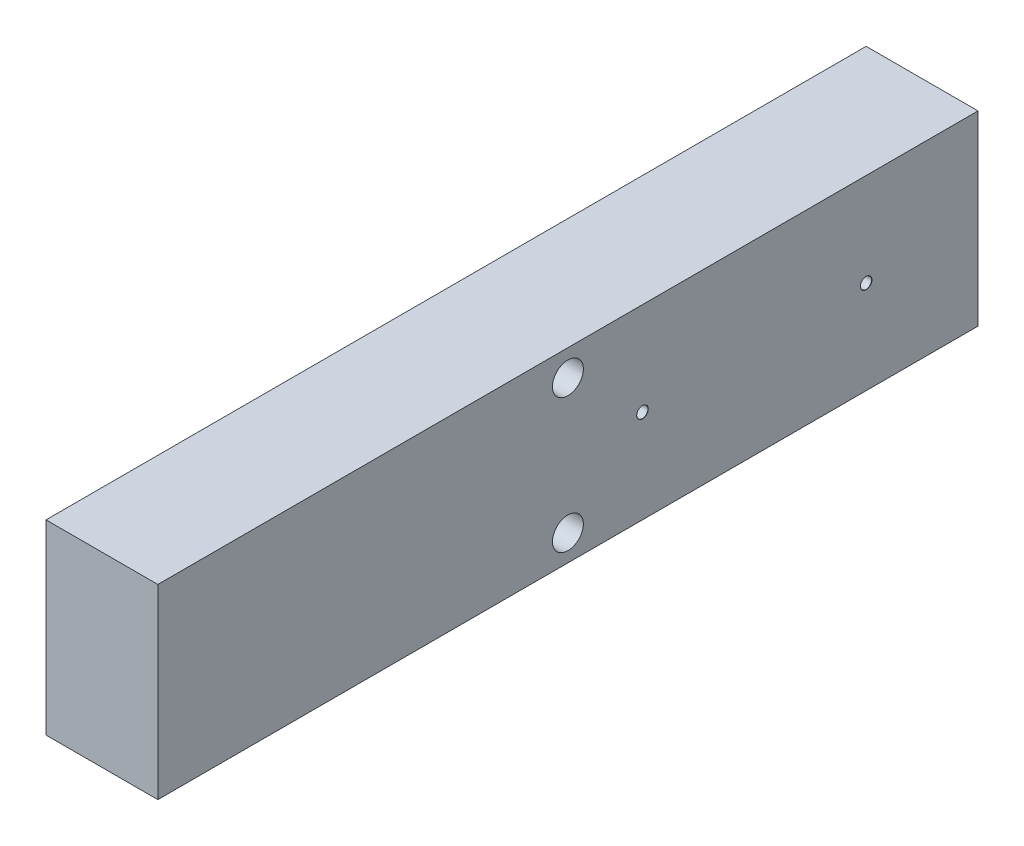
ISO-10303-21;
HEADER;
FILE_DESCRIPTION(('STEP AP214'),'2;1');
FILE_NAME('part.step','',(''),(''),'','','');
FILE_SCHEMA(('AUTOMOTIVE_DESIGN { 1 0 10303 214 1 1 1 1 }'));
ENDSEC;
DATA;
#1=APPLICATION_CONTEXT('core data for automotive mechanical design processes');
#2=APPLICATION_PROTOCOL_DEFINITION('international standard','automotive_design',2000,#1);
#3=PRODUCT_CONTEXT('',#1,'mechanical');
#4=PRODUCT('Part','Part','',(#3));
#5=PRODUCT_RELATED_PRODUCT_CATEGORY('part','',(#4));
#6=PRODUCT_DEFINITION_FORMATION('','',#4);
#7=PRODUCT_DEFINITION_CONTEXT('part definition',#1,'design');
#8=PRODUCT_DEFINITION('design','',#6,#7);
#9=PRODUCT_DEFINITION_SHAPE('','',#8);
#10=(LENGTH_UNIT() NAMED_UNIT(*) SI_UNIT(.MILLI.,.METRE.));
#11=(NAMED_UNIT(*) PLANE_ANGLE_UNIT() SI_UNIT($,.RADIAN.));
#12=(NAMED_UNIT(*) SI_UNIT($,.STERADIAN.) SOLID_ANGLE_UNIT());
#13=UNCERTAINTY_MEASURE_WITH_UNIT(LENGTH_MEASURE(1.E-05),#10,'distance_accuracy_value','');
#14=(GEOMETRIC_REPRESENTATION_CONTEXT(3) GLOBAL_UNCERTAINTY_ASSIGNED_CONTEXT((#13)) GLOBAL_UNIT_ASSIGNED_CONTEXT((#10,
#11,#12)) REPRESENTATION_CONTEXT('',''));
#15=CARTESIAN_POINT('',(0.,0.,0.));
#16=DIRECTION('',(0.,0.,1.));
#17=DIRECTION('',(1.,0.,0.));
#18=AXIS2_PLACEMENT_3D('',#15,#16,#17);
#19=CARTESIAN_POINT('',(15.,12.5,105.));
#20=DIRECTION('',(0.,0.,-1.));
#21=DIRECTION('',(-1.,0.,0.));
#22=AXIS2_PLACEMENT_3D('',#19,#20,#21);
#23=PLANE('',#22);
#24=DIRECTION('',(0.,-1.,0.));
#25=VECTOR('',#24,1.);
#26=CARTESIAN_POINT('',(0.,12.5,105.));
#27=LINE('',#26,#25);
#28=CARTESIAN_POINT('',(0.,12.5,105.));
#29=VERTEX_POINT('',#28);
#30=CARTESIAN_POINT('',(0.,-12.5,105.));
#31=VERTEX_POINT('',#30);
#32=EDGE_CURVE('E254',#29,#31,#27,.T.);
#33=ORIENTED_EDGE('',*,*,#32,.T.);
#34=DIRECTION('',(-1.,0.,0.));
#35=VECTOR('',#34,1.);
#36=CARTESIAN_POINT('',(15.,-12.5,105.));
#37=LINE('',#36,#35);
#38=CARTESIAN_POINT('',(15.,-12.5,105.));
#39=VERTEX_POINT('',#38);
#40=EDGE_CURVE('E139',#39,#31,#37,.T.);
#41=ORIENTED_EDGE('',*,*,#40,.F.);
#42=DIRECTION('',(0.,-1.,0.));
#43=VECTOR('',#42,1.);
#44=CARTESIAN_POINT('',(15.,12.5,105.));
#45=LINE('',#44,#43);
#46=CARTESIAN_POINT('',(15.,12.5,105.));
#47=VERTEX_POINT('',#46);
#48=EDGE_CURVE('E273',#47,#39,#45,.T.);
#49=ORIENTED_EDGE('',*,*,#48,.F.);
#50=DIRECTION('',(-1.,0.,0.));
#51=VECTOR('',#50,1.);
#52=CARTESIAN_POINT('',(15.,12.5,105.));
#53=LINE('',#52,#51);
#54=EDGE_CURVE('E60',#47,#29,#53,.T.);
#55=ORIENTED_EDGE('',*,*,#54,.T.);
#56=EDGE_LOOP('',(#33,#41,#49,#55));
#57=FACE_BOUND('',#56,.T.);
#58=ADVANCED_FACE('F36',(#57),#23,.F.);
#59=CARTESIAN_POINT('',(15.,-12.5,105.));
#60=DIRECTION('',(0.,1.,0.));
#61=DIRECTION('',(1.,0.,0.));
#62=AXIS2_PLACEMENT_3D('',#59,#60,#61);
#63=PLANE('',#62);
#64=DIRECTION('',(0.,0.,-1.));
#65=VECTOR('',#64,1.);
#66=CARTESIAN_POINT('',(0.,-12.5,105.));
#67=LINE('',#66,#65);
#68=CARTESIAN_POINT('',(0.,-12.5,-5.));
#69=VERTEX_POINT('',#68);
#70=EDGE_CURVE('E256',#31,#69,#67,.T.);
#71=ORIENTED_EDGE('',*,*,#70,.T.);
#72=DIRECTION('',(-1.,0.,0.));
#73=VECTOR('',#72,1.);
#74=CARTESIAN_POINT('',(15.,-12.5,-5.));
#75=LINE('',#74,#73);
#76=CARTESIAN_POINT('',(15.,-12.5,-5.));
#77=VERTEX_POINT('',#76);
#78=EDGE_CURVE('E277',#77,#69,#75,.T.);
#79=ORIENTED_EDGE('',*,*,#78,.F.);
#80=DIRECTION('',(0.,0.,-1.));
#81=VECTOR('',#80,1.);
#82=CARTESIAN_POINT('',(15.,-12.5,105.));
#83=LINE('',#82,#81);
#84=EDGE_CURVE('E87',#39,#77,#83,.T.);
#85=ORIENTED_EDGE('',*,*,#84,.F.);
#86=ORIENTED_EDGE('',*,*,#40,.T.);
#87=EDGE_LOOP('',(#71,#79,#85,#86));
#88=FACE_BOUND('',#87,.T.);
#89=ADVANCED_FACE('F248',(#88),#63,.F.);
#90=CARTESIAN_POINT('',(15.,12.5,-5.));
#91=DIRECTION('',(0.,0.,-1.));
#92=DIRECTION('',(-1.,0.,0.));
#93=AXIS2_PLACEMENT_3D('',#90,#91,#92);
#94=PLANE('',#93);
#95=DIRECTION('',(0.,-1.,0.));
#96=VECTOR('',#95,1.);
#97=CARTESIAN_POINT('',(0.,12.5,-5.));
#98=LINE('',#97,#96);
#99=CARTESIAN_POINT('',(0.,12.5,-5.));
#100=VERTEX_POINT('',#99);
#101=EDGE_CURVE('E260',#100,#69,#98,.T.);
#102=ORIENTED_EDGE('',*,*,#101,.F.);
#103=DIRECTION('',(-1.,0.,0.));
#104=VECTOR('',#103,1.);
#105=CARTESIAN_POINT('',(15.,12.5,-5.));
#106=LINE('',#105,#104);
#107=CARTESIAN_POINT('',(15.,12.5,-5.));
#108=VERTEX_POINT('',#107);
#109=EDGE_CURVE('E275',#108,#100,#106,.T.);
#110=ORIENTED_EDGE('',*,*,#109,.F.);
#111=DIRECTION('',(0.,-1.,0.));
#112=VECTOR('',#111,1.);
#113=CARTESIAN_POINT('',(15.,12.5,-5.));
#114=LINE('',#113,#112);
#115=EDGE_CURVE('E282',#108,#77,#114,.T.);
#116=ORIENTED_EDGE('',*,*,#115,.T.);
#117=ORIENTED_EDGE('',*,*,#78,.T.);
#118=EDGE_LOOP('',(#102,#110,#116,#117));
#119=FACE_BOUND('',#118,.T.);
#120=ADVANCED_FACE('F252',(#119),#94,.T.);
#121=CARTESIAN_POINT('',(15.,12.5,105.));
#122=DIRECTION('',(0.,1.,0.));
#123=DIRECTION('',(1.,0.,0.));
#124=AXIS2_PLACEMENT_3D('',#121,#122,#123);
#125=PLANE('',#124);
#126=DIRECTION('',(0.,0.,-1.));
#127=VECTOR('',#126,1.);
#128=CARTESIAN_POINT('',(0.,12.5,105.));
#129=LINE('',#128,#127);
#130=EDGE_CURVE('E271',#29,#100,#129,.T.);
#131=ORIENTED_EDGE('',*,*,#130,.F.);
#132=ORIENTED_EDGE('',*,*,#54,.F.);
#133=DIRECTION('',(0.,0.,-1.));
#134=VECTOR('',#133,1.);
#135=CARTESIAN_POINT('',(15.,12.5,105.));
#136=LINE('',#135,#134);
#137=EDGE_CURVE('E266',#47,#108,#136,.T.);
#138=ORIENTED_EDGE('',*,*,#137,.T.);
#139=ORIENTED_EDGE('',*,*,#109,.T.);
#140=EDGE_LOOP('',(#131,#132,#138,#139));
#141=FACE_BOUND('',#140,.T.);
#142=ADVANCED_FACE('F373',(#141),#125,.T.);
#143=CARTESIAN_POINT('',(15.,0.,0.));
#144=DIRECTION('',(1.,0.,0.));
#145=DIRECTION('',(0.,0.,-1.));
#146=AXIS2_PLACEMENT_3D('',#143,#144,#145);
#147=PLANE('',#146);
#148=CARTESIAN_POINT('',(15.,9.,50.));
#149=DIRECTION('',(-1.,0.,0.));
#150=DIRECTION('',(0.,0.,1.));
#151=AXIS2_PLACEMENT_3D('',#148,#149,#150);
#152=CIRCLE('',#151,2.075);
#153=CARTESIAN_POINT('',(15.,9.,52.075));
#154=VERTEX_POINT('',#153);
#155=EDGE_CURVE('E332',#154,#154,#152,.T.);
#156=ORIENTED_EDGE('',*,*,#155,.T.);
#157=EDGE_LOOP('',(#156));
#158=FACE_BOUND('',#157,.T.);
#159=CARTESIAN_POINT('',(15.,-9.,50.));
#160=DIRECTION('',(-1.,0.,0.));
#161=DIRECTION('',(0.,0.,1.));
#162=AXIS2_PLACEMENT_3D('',#159,#160,#161);
#163=CIRCLE('',#162,2.075);
#164=CARTESIAN_POINT('',(15.,-9.,52.075));
#165=VERTEX_POINT('',#164);
#166=EDGE_CURVE('E329',#165,#165,#163,.T.);
#167=ORIENTED_EDGE('',*,*,#166,.T.);
#168=EDGE_LOOP('',(#167));
#169=FACE_BOUND('',#168,.T.);
#170=CARTESIAN_POINT('',(15.,0.,40.));
#171=DIRECTION('',(1.,0.,0.));
#172=DIRECTION('',(0.,0.,-1.));
#173=AXIS2_PLACEMENT_3D('',#170,#171,#172);
#174=CIRCLE('',#173,0.775);
#175=CARTESIAN_POINT('',(15.,0.,39.225));
#176=VERTEX_POINT('',#175);
#177=EDGE_CURVE('E323',#176,#176,#174,.T.);
#178=ORIENTED_EDGE('',*,*,#177,.F.);
#179=EDGE_LOOP('',(#178));
#180=FACE_BOUND('',#179,.T.);
#181=CARTESIAN_POINT('',(15.,0.,9.99999999999999));
#182=DIRECTION('',(1.,0.,0.));
#183=DIRECTION('',(0.,0.,-1.));
#184=AXIS2_PLACEMENT_3D('',#181,#182,#183);
#185=CIRCLE('',#184,0.775);
#186=CARTESIAN_POINT('',(15.,0.,9.225));
#187=VERTEX_POINT('',#186);
#188=EDGE_CURVE('E317',#187,#187,#185,.T.);
#189=ORIENTED_EDGE('',*,*,#188,.F.);
#190=EDGE_LOOP('',(#189));
#191=FACE_BOUND('',#190,.T.);
#192=ORIENTED_EDGE('',*,*,#48,.T.);
#193=ORIENTED_EDGE('',*,*,#84,.T.);
#194=ORIENTED_EDGE('',*,*,#115,.F.);
#195=ORIENTED_EDGE('',*,*,#137,.F.);
#196=EDGE_LOOP('',(#192,#193,#194,#195));
#197=FACE_BOUND('',#196,.T.);
#198=ADVANCED_FACE('F370',(#158,#169,#180,#191,#197),#147,.T.);
#199=CARTESIAN_POINT('',(0.,0.,0.));
#200=DIRECTION('',(1.,0.,0.));
#201=DIRECTION('',(0.,0.,-1.));
#202=AXIS2_PLACEMENT_3D('',#199,#200,#201);
#203=PLANE('',#202);
#204=CARTESIAN_POINT('',(0.,9.,50.));
#205=DIRECTION('',(1.,0.,0.));
#206=DIRECTION('',(0.,0.,-1.));
#207=AXIS2_PLACEMENT_3D('',#204,#205,#206);
#208=CIRCLE('',#207,2.07499999999999);
#209=CARTESIAN_POINT('',(0.,9.,47.925));
#210=VERTEX_POINT('',#209);
#211=EDGE_CURVE('E39',#210,#210,#208,.T.);
#212=ORIENTED_EDGE('',*,*,#211,.T.);
#213=EDGE_LOOP('',(#212));
#214=FACE_BOUND('',#213,.T.);
#215=CARTESIAN_POINT('',(0.,-9.,50.));
#216=DIRECTION('',(1.,0.,0.));
#217=DIRECTION('',(0.,0.,-1.));
#218=AXIS2_PLACEMENT_3D('',#215,#216,#217);
#219=CIRCLE('',#218,2.07499999999999);
#220=CARTESIAN_POINT('',(0.,-9.,47.925));
#221=VERTEX_POINT('',#220);
#222=EDGE_CURVE('E326',#221,#221,#219,.T.);
#223=ORIENTED_EDGE('',*,*,#222,.T.);
#224=EDGE_LOOP('',(#223));
#225=FACE_BOUND('',#224,.T.);
#226=DIRECTION('',(0.,0.,-1.));
#227=VECTOR('',#226,1.);
#228=CARTESIAN_POINT('',(0.,-2.50097322315044,101.));
#229=LINE('',#228,#227);
#230=CARTESIAN_POINT('',(0.,-2.50097322315044,101.));
#231=VERTEX_POINT('',#230);
#232=CARTESIAN_POINT('',(0.,-2.50097322315044,100.));
#233=VERTEX_POINT('',#232);
#234=EDGE_CURVE('E177',#231,#233,#229,.T.);
#235=ORIENTED_EDGE('',*,*,#234,.F.);
#236=DIRECTION('',(0.,-1.,0.));
#237=VECTOR('',#236,1.);
#238=CARTESIAN_POINT('',(0.,0.,101.));
#239=LINE('',#238,#237);
#240=CARTESIAN_POINT('',(0.,-3.60097322315044,101.));
#241=VERTEX_POINT('',#240);
#242=EDGE_CURVE('E11',#231,#241,#239,.T.);
#243=ORIENTED_EDGE('',*,*,#242,.T.);
#244=DIRECTION('',(0.,0.,-1.));
#245=VECTOR('',#244,1.);
#246=CARTESIAN_POINT('',(0.,-3.60097322315044,101.));
#247=LINE('',#246,#245);
#248=CARTESIAN_POINT('',(0.,-3.60097322315044,100.));
#249=VERTEX_POINT('',#248);
#250=EDGE_CURVE('E44',#249,#241,#247,.F.);
#251=ORIENTED_EDGE('',*,*,#250,.F.);
#252=DIRECTION('',(0.,-1.,0.));
#253=VECTOR('',#252,1.);
#254=CARTESIAN_POINT('',(0.,0.,100.));
#255=LINE('',#254,#253);
#256=CARTESIAN_POINT('',(0.,-5.,100.));
#257=VERTEX_POINT('',#256);
#258=EDGE_CURVE('E176',#249,#257,#255,.T.);
#259=ORIENTED_EDGE('',*,*,#258,.T.);
#260=DIRECTION('',(0.,0.,-1.));
#261=VECTOR('',#260,1.);
#262=CARTESIAN_POINT('',(0.,-5.,100.));
#263=LINE('',#262,#261);
#264=CARTESIAN_POINT('',(0.,-5.,0.));
#265=VERTEX_POINT('',#264);
#266=EDGE_CURVE('E169',#265,#257,#263,.F.);
#267=ORIENTED_EDGE('',*,*,#266,.F.);
#268=DIRECTION('',(0.,-1.,0.));
#269=VECTOR('',#268,1.);
#270=CARTESIAN_POINT('',(0.,0.,0.));
#271=LINE('',#270,#269);
#272=CARTESIAN_POINT('',(0.,5.,0.));
#273=VERTEX_POINT('',#272);
#274=EDGE_CURVE('E167',#273,#265,#271,.T.);
#275=ORIENTED_EDGE('',*,*,#274,.F.);
#276=DIRECTION('',(0.,0.,-1.));
#277=VECTOR('',#276,1.);
#278=CARTESIAN_POINT('',(0.,5.,100.));
#279=LINE('',#278,#277);
#280=CARTESIAN_POINT('',(0.,5.,100.));
#281=VERTEX_POINT('',#280);
#282=EDGE_CURVE('E163',#281,#273,#279,.T.);
#283=ORIENTED_EDGE('',*,*,#282,.F.);
#284=CARTESIAN_POINT('',(0.,3.60097322315044,100.));
#285=VERTEX_POINT('',#284);
#286=EDGE_CURVE('E154',#281,#285,#255,.T.);
#287=ORIENTED_EDGE('',*,*,#286,.T.);
#288=DIRECTION('',(0.,0.,-1.));
#289=VECTOR('',#288,1.);
#290=CARTESIAN_POINT('',(0.,3.60097322315044,101.));
#291=LINE('',#290,#289);
#292=CARTESIAN_POINT('',(0.,3.60097322315044,101.));
#293=VERTEX_POINT('',#292);
#294=EDGE_CURVE('E138',#293,#285,#291,.T.);
#295=ORIENTED_EDGE('',*,*,#294,.F.);
#296=DIRECTION('',(0.,-1.,0.));
#297=VECTOR('',#296,1.);
#298=CARTESIAN_POINT('',(0.,0.,101.));
#299=LINE('',#298,#297);
#300=CARTESIAN_POINT('',(0.,2.50097322315044,101.));
#301=VERTEX_POINT('',#300);
#302=EDGE_CURVE('E133',#293,#301,#299,.T.);
#303=ORIENTED_EDGE('',*,*,#302,.T.);
#304=DIRECTION('',(0.,0.,-1.));
#305=VECTOR('',#304,1.);
#306=CARTESIAN_POINT('',(0.,2.50097322315044,101.));
#307=LINE('',#306,#305);
#308=CARTESIAN_POINT('',(0.,2.50097322315044,100.));
#309=VERTEX_POINT('',#308);
#310=EDGE_CURVE('E145',#309,#301,#307,.F.);
#311=ORIENTED_EDGE('',*,*,#310,.F.);
#312=CARTESIAN_POINT('',(0.,1.1,100.));
#313=VERTEX_POINT('',#312);
#314=EDGE_CURVE('E156',#309,#313,#255,.T.);
#315=ORIENTED_EDGE('',*,*,#314,.T.);
#316=DIRECTION('',(0.,0.,-1.));
#317=VECTOR('',#316,1.);
#318=CARTESIAN_POINT('',(0.,1.1,101.));
#319=LINE('',#318,#317);
#320=CARTESIAN_POINT('',(0.,1.1,101.));
#321=VERTEX_POINT('',#320);
#322=EDGE_CURVE('E165',#321,#313,#319,.T.);
#323=ORIENTED_EDGE('',*,*,#322,.F.);
#324=DIRECTION('',(0.,-1.,0.));
#325=VECTOR('',#324,1.);
#326=CARTESIAN_POINT('',(0.,0.,101.));
#327=LINE('',#326,#325);
#328=CARTESIAN_POINT('',(0.,-1.1,101.));
#329=VERTEX_POINT('',#328);
#330=EDGE_CURVE('E171',#321,#329,#327,.T.);
#331=ORIENTED_EDGE('',*,*,#330,.T.);
#332=DIRECTION('',(0.,0.,-1.));
#333=VECTOR('',#332,1.);
#334=CARTESIAN_POINT('',(0.,-1.1,101.));
#335=LINE('',#334,#333);
#336=CARTESIAN_POINT('',(0.,-1.1,100.));
#337=VERTEX_POINT('',#336);
#338=EDGE_CURVE('E174',#337,#329,#335,.F.);
#339=ORIENTED_EDGE('',*,*,#338,.F.);
#340=EDGE_CURVE('E162',#337,#233,#255,.T.);
#341=ORIENTED_EDGE('',*,*,#340,.T.);
#342=EDGE_LOOP('',(#235,#243,#251,#259,#267,#275,#283,#287,#295,#303,#311,#315,#323,#331,#339,#341));
#343=FACE_BOUND('',#342,.T.);
#344=ORIENTED_EDGE('',*,*,#32,.F.);
#345=ORIENTED_EDGE('',*,*,#130,.T.);
#346=ORIENTED_EDGE('',*,*,#101,.T.);
#347=ORIENTED_EDGE('',*,*,#70,.F.);
#348=EDGE_LOOP('',(#344,#345,#346,#347));
#349=FACE_BOUND('',#348,.T.);
#350=ADVANCED_FACE('F151',(#214,#225,#343,#349),#203,.F.);
#351=CARTESIAN_POINT('',(0.,0.,100.));
#352=DIRECTION('',(0.,0.,-1.));
#353=DIRECTION('',(-1.,0.,0.));
#354=AXIS2_PLACEMENT_3D('',#351,#352,#353);
#355=CYLINDRICAL_SURFACE('',#354,5.);
#356=CARTESIAN_POINT('',(5.,0.,39.25));
#357=CARTESIAN_POINT('',(4.99999932885649,-0.0418757722408211,39.2500017269076));
#358=CARTESIAN_POINT('',(4.9994684126852,-0.083775842541066,39.2535190004203));
#359=CARTESIAN_POINT('',(4.99740157986594,-0.166404813997457,39.2674915999914));
#360=CARTESIAN_POINT('',(4.99586468469237,-0.207132534487115,39.2779536814724));
#361=CARTESIAN_POINT('',(4.99195860609763,-0.28620904311093,39.3054962524838));
#362=CARTESIAN_POINT('',(4.9895900518546,-0.324559603913398,39.322571739753));
#363=CARTESIAN_POINT('',(4.98428237955862,-0.397845214317626,39.3628441897084));
#364=CARTESIAN_POINT('',(4.98134334076386,-0.432780737362595,39.3860403022087));
#365=CARTESIAN_POINT('',(4.97519585495726,-0.498523359781063,39.4380886324699));
#366=CARTESIAN_POINT('',(4.97198566945166,-0.529299916112749,39.4669792281041));
#367=CARTESIAN_POINT('',(4.96567130566619,-0.585587453344741,39.5295138444469));
#368=CARTESIAN_POINT('',(4.96256713349253,-0.611098131364679,39.5631581383893));
#369=CARTESIAN_POINT('',(4.95679938729363,-0.656248647499715,39.6344503217612));
#370=CARTESIAN_POINT('',(4.95413805987515,-0.675858935186024,39.6721171234907));
#371=CARTESIAN_POINT('',(4.94958105653134,-0.708463160855278,39.7502564103227));
#372=CARTESIAN_POINT('',(4.94768533887724,-0.721457459445813,39.7907287423719));
#373=CARTESIAN_POINT('',(4.94489128109337,-0.740365993994552,39.8730090209358));
#374=CARTESIAN_POINT('',(4.94398557870625,-0.746332518202585,39.914804696704));
#375=CARTESIAN_POINT('',(4.94325174485291,-0.75117812016966,39.9988130829936));
#376=CARTESIAN_POINT('',(4.94342355151574,-0.750057604868979,40.0410257694312));
#377=CARTESIAN_POINT('',(4.94481859176205,-0.740803666253937,40.1243005400971));
#378=CARTESIAN_POINT('',(4.94603309380775,-0.732728479638751,40.1653692632424));
#379=CARTESIAN_POINT('',(4.94936304063184,-0.709885587018669,40.2455621844358));
#380=CARTESIAN_POINT('',(4.9514785108969,-0.695117691689057,40.2846863274404));
#381=CARTESIAN_POINT('',(4.9563816777274,-0.659248017648679,40.3600566856414));
#382=CARTESIAN_POINT('',(4.95917198383263,-0.638121571415986,40.3962909845462));
#383=CARTESIAN_POINT('',(4.96510853787274,-0.590152065644772,40.464722297891));
#384=CARTESIAN_POINT('',(4.9682548091625,-0.56330863091239,40.4969190471347));
#385=CARTESIAN_POINT('',(4.97458736528105,-0.50434746539124,40.5566988303698));
#386=CARTESIAN_POINT('',(4.97777373556407,-0.472179664821003,40.5842324951432));
#387=CARTESIAN_POINT('',(4.98379823824231,-0.403653544947095,40.6335179672536));
#388=CARTESIAN_POINT('',(4.98663636911255,-0.367295207294085,40.6552697492719));
#389=CARTESIAN_POINT('',(4.99164757792697,-0.291377299106841,40.6923765432498));
#390=CARTESIAN_POINT('',(4.99382025962714,-0.251815838918389,40.7077277459201));
#391=CARTESIAN_POINT('',(4.99725245278535,-0.170636591243529,40.7315546948427));
#392=CARTESIAN_POINT('',(4.99851202597734,-0.129018942976299,40.7400309059078));
#393=CARTESIAN_POINT('',(4.99996790566936,-0.0453347838218222,40.7498016149083));
#394=CARTESIAN_POINT('',(5.00017426045194,-0.00327636593523445,40.7511639856897));
#395=CARTESIAN_POINT('',(4.99952780507613,0.0804683388311423,40.7468484973445));
#396=CARTESIAN_POINT('',(4.99867502770684,0.12215463719094,40.7411708561659));
#397=CARTESIAN_POINT('',(4.99601234307667,0.203766193715704,40.7229929499112));
#398=CARTESIAN_POINT('',(4.99420707603992,0.243698981539918,40.7105257519846));
#399=CARTESIAN_POINT('',(4.98984117829185,0.320907479321498,40.6791575012691));
#400=CARTESIAN_POINT('',(4.98728051210783,0.35818306439755,40.6602561463332));
#401=CARTESIAN_POINT('',(4.98166341234343,0.429317489645962,40.6163968877181));
#402=CARTESIAN_POINT('',(4.97860350813373,0.463149504945784,40.5913959299936));
#403=CARTESIAN_POINT('',(4.97233931506082,0.526161836588853,40.5361070941856));
#404=CARTESIAN_POINT('',(4.96913501781434,0.555341882396701,40.5058189088377));
#405=CARTESIAN_POINT('',(4.96291132152247,0.608468924785978,40.4405132334117));
#406=CARTESIAN_POINT('',(4.95989368008794,0.632370423737108,40.4054585374026));
#407=CARTESIAN_POINT('',(4.95441609552452,0.673945646352923,40.3317919797441));
#408=CARTESIAN_POINT('',(4.95195613732814,0.69161953828218,40.2931802142393));
#409=CARTESIAN_POINT('',(4.94788516504322,0.720167336619716,40.2136312331884));
#410=CARTESIAN_POINT('',(4.94627116503219,0.731065185708175,40.1727027695144));
#411=CARTESIAN_POINT('',(4.94406691148901,0.745827747507929,40.0895704922824));
#412=CARTESIAN_POINT('',(4.94347658725886,0.74969294591533,40.0473667670027));
#413=CARTESIAN_POINT('',(4.94338916305421,0.750268933347197,39.9633354683421));
#414=CARTESIAN_POINT('',(4.94388113166751,0.747051260836561,39.9215083791215));
#415=CARTESIAN_POINT('',(4.94587910305587,0.73370614772189,39.8389973683382));
#416=CARTESIAN_POINT('',(4.94738510420559,0.723578718193131,39.7983134449433));
#417=CARTESIAN_POINT('',(4.95123763056149,0.696726867593321,39.7192634588828));
#418=CARTESIAN_POINT('',(4.95358351858038,0.680007446621565,39.6808956647833));
#419=CARTESIAN_POINT('',(4.95885227278851,0.640453338211539,39.6074981830988));
#420=CARTESIAN_POINT('',(4.96177515851362,0.617618443707505,39.5724686085982));
#421=CARTESIAN_POINT('',(4.96790371682469,0.566221688295817,39.5063784710124));
#422=CARTESIAN_POINT('',(4.97111183940984,0.537606845199025,39.4753593333765));
#423=CARTESIAN_POINT('',(4.97742894413318,0.475574420541413,39.4185377226061));
#424=CARTESIAN_POINT('',(4.9805379030538,0.442155724175465,39.3927364637119));
#425=CARTESIAN_POINT('',(4.9863259289526,0.371247853771855,39.3469561616963));
#426=CARTESIAN_POINT('',(4.9890025356441,0.333737288382376,39.3270099453926));
#427=CARTESIAN_POINT('',(4.9936001440148,0.255875935124357,39.293730741621));
#428=CARTESIAN_POINT('',(4.99552192782878,0.215528138548349,39.2803909049732));
#429=CARTESIAN_POINT('',(4.99795469630753,0.145832863944662,39.2637293286449));
#430=CARTESIAN_POINT('',(4.99871774589778,0.116915566747638,39.2585886992306));
#431=CARTESIAN_POINT('',(4.99974062973948,0.0586694858000623,39.2517234511437));
#432=CARTESIAN_POINT('',(5.00000047024387,0.0293407071672084,39.2499987900237));
#433=CARTESIAN_POINT('',(5.,0.,39.25));
#434=B_SPLINE_CURVE_WITH_KNOTS('',3,(#356,#357,#358,#359,#360,#361,#362,#363,#364,#365,#366,
#367,#368,#369,#370,#371,#372,#373,#374,#375,#376,#377,#378,#379,#380,#381,#382,#383,#384,#385,
#386,#387,#388,#389,#390,#391,#392,#393,#394,#395,#396,#397,#398,#399,#400,#401,#402,#403,#404,
#405,#406,#407,#408,#409,#410,#411,#412,#413,#414,#415,#416,#417,#418,#419,#420,#421,#422,#423,
#424,#425,#426,#427,#428,#429,#430,#431,#432,#433),.UNSPECIFIED.,.T.,.F.,(4,2,2,2,2,2,2,2,2,2,2,
2,2,2,2,2,2,2,2,2,2,2,2,2,2,2,2,2,2,2,2,2,2,2,2,2,2,2,4),(0.,0.125520102515832,
0.251162481464576,0.376710011791618,0.502240112098801,0.628647080684213,0.7550613178629,
0.882098511976875,1.00912878112753,1.13520782302961,1.26127962549491,1.38630588597872,
1.5113356834518,1.63685691738079,1.76238639154266,1.88917145627703,2.01595707619333,
2.14281804492436,2.269670435967,2.39531029272127,2.52094625995577,2.64597574482973,
2.77101110188136,2.89695594018453,3.02290810014314,3.14990683292336,3.27690213404416,
3.40344611728583,3.52998136068587,3.65524444130532,3.78050732114782,3.90567536992073,
4.03084765733439,4.1572241498286,4.28363001734366,4.41073161692366,4.5377011663072,
4.62564925989403,4.71359626061644),.UNSPECIFIED.);
#435=CARTESIAN_POINT('',(5.,0.,39.25));
#436=VERTEX_POINT('',#435);
#437=EDGE_CURVE('E187',#436,#436,#434,.T.);
#438=ORIENTED_EDGE('',*,*,#437,.F.);
#439=EDGE_LOOP('',(#438));
#440=FACE_BOUND('',#439,.T.);
#441=CARTESIAN_POINT('',(5.,0.,9.25));
#442=CARTESIAN_POINT('',(4.99999932885649,-0.041875772240821,9.25000172690762));
#443=CARTESIAN_POINT('',(4.9994684126852,-0.0837758425410657,9.25351900042032));
#444=CARTESIAN_POINT('',(4.99740157986594,-0.166404813997456,9.26749159999137));
#445=CARTESIAN_POINT('',(4.99586468469237,-0.207132534487114,9.27795368147244));
#446=CARTESIAN_POINT('',(4.99195860609763,-0.286209043110929,9.30549625248381));
#447=CARTESIAN_POINT('',(4.9895900518546,-0.324559603913398,9.32257173975297));
#448=CARTESIAN_POINT('',(4.98428237955862,-0.397845214317626,9.36284418970843));
#449=CARTESIAN_POINT('',(4.98134334076386,-0.432780737362593,9.38604030220868));
#450=CARTESIAN_POINT('',(4.97519585495726,-0.498523359781061,9.43808863246993));
#451=CARTESIAN_POINT('',(4.97198566945166,-0.529299916112748,9.4669792281041));
#452=CARTESIAN_POINT('',(4.96567130566619,-0.58558745334474,9.52951384444693));
#453=CARTESIAN_POINT('',(4.96256713349253,-0.611098131364677,9.56315813838926));
#454=CARTESIAN_POINT('',(4.95679938729363,-0.656248647499712,9.63445032176124));
#455=CARTESIAN_POINT('',(4.95413805987515,-0.675858935186022,9.67211712349066));
#456=CARTESIAN_POINT('',(4.94958105653134,-0.708463160855277,9.75025641032271));
#457=CARTESIAN_POINT('',(4.94768533887724,-0.721457459445812,9.79072874237194));
#458=CARTESIAN_POINT('',(4.94489128109337,-0.740365993994553,9.87300902093585));
#459=CARTESIAN_POINT('',(4.94398557870625,-0.746332518202586,9.91480469670401));
#460=CARTESIAN_POINT('',(4.94325174485291,-0.751178120169659,9.99881308299364));
#461=CARTESIAN_POINT('',(4.94342355151574,-0.750057604868979,10.0410257694312));
#462=CARTESIAN_POINT('',(4.94481859176205,-0.740803666253935,10.1243005400971));
#463=CARTESIAN_POINT('',(4.94603309380775,-0.732728479638749,10.1653692632424));
#464=CARTESIAN_POINT('',(4.94936304063184,-0.709885587018669,10.2455621844358));
#465=CARTESIAN_POINT('',(4.9514785108969,-0.695117691689059,10.2846863274404));
#466=CARTESIAN_POINT('',(4.9563816777274,-0.659248017648681,10.3600566856414));
#467=CARTESIAN_POINT('',(4.95917198383263,-0.638121571415987,10.3962909845462));
#468=CARTESIAN_POINT('',(4.96510853787274,-0.590152065644772,10.464722297891));
#469=CARTESIAN_POINT('',(4.9682548091625,-0.563308630912389,10.4969190471347));
#470=CARTESIAN_POINT('',(4.97458736528105,-0.504347465391238,10.5566988303699));
#471=CARTESIAN_POINT('',(4.97777373556407,-0.472179664820999,10.5842324951432));
#472=CARTESIAN_POINT('',(4.98379823824231,-0.403653544947092,10.6335179672536));
#473=CARTESIAN_POINT('',(4.98663636911255,-0.367295207294083,10.6552697492719));
#474=CARTESIAN_POINT('',(4.99164757792697,-0.291377299106841,10.6923765432498));
#475=CARTESIAN_POINT('',(4.99382025962714,-0.251815838918389,10.7077277459201));
#476=CARTESIAN_POINT('',(4.99725245278535,-0.17063659124353,10.7315546948427));
#477=CARTESIAN_POINT('',(4.99851202597734,-0.1290189429763,10.7400309059078));
#478=CARTESIAN_POINT('',(4.99996790566936,-0.0453347838218231,10.7498016149083));
#479=CARTESIAN_POINT('',(5.00017426045194,-0.00327636593523537,10.7511639856897));
#480=CARTESIAN_POINT('',(4.99952780507613,0.0804683388311409,10.7468484973445));
#481=CARTESIAN_POINT('',(4.99867502770684,0.122154637190938,10.7411708561659));
#482=CARTESIAN_POINT('',(4.99601234307667,0.203766193715704,10.7229929499112));
#483=CARTESIAN_POINT('',(4.99420707603992,0.243698981539918,10.7105257519846));
#484=CARTESIAN_POINT('',(4.98984117829185,0.320907479321499,10.6791575012691));
#485=CARTESIAN_POINT('',(4.98728051210783,0.358183064397549,10.6602561463332));
#486=CARTESIAN_POINT('',(4.98166341234343,0.42931748964596,10.6163968877181));
#487=CARTESIAN_POINT('',(4.97860350813373,0.463149504945781,10.5913959299936));
#488=CARTESIAN_POINT('',(4.97233931506082,0.526161836588851,10.5361070941856));
#489=CARTESIAN_POINT('',(4.96913501781434,0.5553418823967,10.5058189088377));
#490=CARTESIAN_POINT('',(4.96291132152247,0.608468924785975,10.4405132334117));
#491=CARTESIAN_POINT('',(4.95989368008794,0.632370423737103,10.4054585374026));
#492=CARTESIAN_POINT('',(4.95441609552452,0.673945646352918,10.3317919797441));
#493=CARTESIAN_POINT('',(4.95195613732814,0.691619538282177,10.2931802142393));
#494=CARTESIAN_POINT('',(4.94788516504323,0.720167336619715,10.2136312331884));
#495=CARTESIAN_POINT('',(4.94627116503219,0.731065185708175,10.1727027695144));
#496=CARTESIAN_POINT('',(4.94406691148901,0.745827747507929,10.0895704922824));
#497=CARTESIAN_POINT('',(4.94347658725886,0.74969294591533,10.0473667670027));
#498=CARTESIAN_POINT('',(4.94338916305421,0.750268933347197,9.96333546834211));
#499=CARTESIAN_POINT('',(4.94388113166751,0.747051260836561,9.92150837912154));
#500=CARTESIAN_POINT('',(4.94587910305587,0.733706147721892,9.83899736833824));
#501=CARTESIAN_POINT('',(4.94738510420559,0.723578718193133,9.7983134449433));
#502=CARTESIAN_POINT('',(4.95123763056149,0.696726867593323,9.71926345888283));
#503=CARTESIAN_POINT('',(4.95358351858038,0.680007446621568,9.68089566478328));
#504=CARTESIAN_POINT('',(4.95885227278851,0.640453338211543,9.6074981830988));
#505=CARTESIAN_POINT('',(4.96177515851362,0.617618443707508,9.57246860859817));
#506=CARTESIAN_POINT('',(4.96790371682469,0.566221688295819,9.50637847101241));
#507=CARTESIAN_POINT('',(4.97111183940984,0.537606845199027,9.47535933337646));
#508=CARTESIAN_POINT('',(4.97742894413318,0.475574420541416,9.41853772260608));
#509=CARTESIAN_POINT('',(4.9805379030538,0.442155724175469,9.39273646371192));
#510=CARTESIAN_POINT('',(4.9863259289526,0.371247853771859,9.34695616169631));
#511=CARTESIAN_POINT('',(4.9890025356441,0.333737288382379,9.32700994539262));
#512=CARTESIAN_POINT('',(4.9936001440148,0.255875935124359,9.29373074162097));
#513=CARTESIAN_POINT('',(4.99552192782878,0.215528138548352,9.28039090497315));
#514=CARTESIAN_POINT('',(4.99795469630753,0.145832863944665,9.26372932864494));
#515=CARTESIAN_POINT('',(4.99871774589778,0.11691556674764,9.25858869923059));
#516=CARTESIAN_POINT('',(4.99974062973948,0.0586694858000631,9.25172345114368));
#517=CARTESIAN_POINT('',(5.00000047024387,0.0293407071672088,9.24999879002372));
#518=CARTESIAN_POINT('',(5.,0.,9.25));
#519=B_SPLINE_CURVE_WITH_KNOTS('',3,(#441,#442,#443,#444,#445,#446,#447,#448,#449,#450,#451,
#452,#453,#454,#455,#456,#457,#458,#459,#460,#461,#462,#463,#464,#465,#466,#467,#468,#469,#470,
#471,#472,#473,#474,#475,#476,#477,#478,#479,#480,#481,#482,#483,#484,#485,#486,#487,#488,#489,
#490,#491,#492,#493,#494,#495,#496,#497,#498,#499,#500,#501,#502,#503,#504,#505,#506,#507,#508,
#509,#510,#511,#512,#513,#514,#515,#516,#517,#518),.UNSPECIFIED.,.T.,.F.,(4,2,2,2,2,2,2,2,2,2,2,
2,2,2,2,2,2,2,2,2,2,2,2,2,2,2,2,2,2,2,2,2,2,2,2,2,2,2,4),(0.,0.125520102515831,
0.251162481464574,0.376710011791617,0.502240112098797,0.628647080684214,0.755061317862896,
0.882098511976872,1.00912878112753,1.13520782302962,1.26127962549491,1.38630588597873,
1.5113356834518,1.63685691738079,1.76238639154267,1.88917145627704,2.01595707619333,
2.14281804492437,2.269670435967,2.39531029272127,2.52094625995577,2.64597574482973,
2.77101110188136,2.89695594018453,3.02290810014314,3.14990683292335,3.27690213404415,
3.40344611728583,3.52998136068587,3.65524444130531,3.78050732114781,3.90567536992072,
4.03084765733438,4.15722414982859,4.28363001734365,4.41073161692365,4.53770116630719,
4.62564925989403,4.71359626061644),.UNSPECIFIED.);
#520=CARTESIAN_POINT('',(5.,0.,9.25));
#521=VERTEX_POINT('',#520);
#522=EDGE_CURVE('E147',#521,#521,#519,.T.);
#523=ORIENTED_EDGE('',*,*,#522,.F.);
#524=EDGE_LOOP('',(#523));
#525=FACE_BOUND('',#524,.T.);
#526=ORIENTED_EDGE('',*,*,#266,.T.);
#527=CARTESIAN_POINT('',(0.,0.,100.));
#528=DIRECTION('',(0.,0.,1.));
#529=DIRECTION('',(1.,0.,0.));
#530=AXIS2_PLACEMENT_3D('',#527,#528,#529);
#531=CIRCLE('',#530,5.);
#532=EDGE_CURVE('E263',#257,#281,#531,.T.);
#533=ORIENTED_EDGE('',*,*,#532,.T.);
#534=ORIENTED_EDGE('',*,*,#282,.T.);
#535=CARTESIAN_POINT('',(0.,0.,0.));
#536=DIRECTION('',(0.,0.,1.));
#537=DIRECTION('',(1.,0.,0.));
#538=AXIS2_PLACEMENT_3D('',#535,#536,#537);
#539=CIRCLE('',#538,5.);
#540=EDGE_CURVE('E288',#265,#273,#539,.T.);
#541=ORIENTED_EDGE('',*,*,#540,.F.);
#542=EDGE_LOOP('',(#526,#533,#534,#541));
#543=FACE_BOUND('',#542,.T.);
#544=ADVANCED_FACE('F192',(#440,#525,#543),#355,.F.);
#545=CARTESIAN_POINT('',(0.,0.,100.));
#546=DIRECTION('',(0.,0.,1.));
#547=DIRECTION('',(1.,0.,0.));
#548=AXIS2_PLACEMENT_3D('',#545,#546,#547);
#549=PLANE('',#548);
#550=CARTESIAN_POINT('',(2.64222031751435,1.52548661157525,100.));
#551=DIRECTION('',(0.,0.,1.));
#552=DIRECTION('',(1.,0.,0.));
#553=AXIS2_PLACEMENT_3D('',#550,#551,#552);
#554=CIRCLE('',#553,0.55);
#555=CARTESIAN_POINT('',(3.19222031751435,1.52548661157525,100.));
#556=VERTEX_POINT('',#555);
#557=EDGE_CURVE('E296',#556,#556,#554,.T.);
#558=ORIENTED_EDGE('',*,*,#557,.T.);
#559=EDGE_LOOP('',(#558));
#560=FACE_BOUND('',#559,.T.);
#561=CARTESIAN_POINT('',(2.64222031751438,-1.52548661157519,100.));
#562=DIRECTION('',(0.,0.,1.));
#563=DIRECTION('',(1.,0.,0.));
#564=AXIS2_PLACEMENT_3D('',#561,#562,#563);
#565=CIRCLE('',#564,0.55);
#566=CARTESIAN_POINT('',(3.19222031751438,-1.52548661157519,100.));
#567=VERTEX_POINT('',#566);
#568=EDGE_CURVE('E300',#567,#567,#565,.T.);
#569=ORIENTED_EDGE('',*,*,#568,.T.);
#570=EDGE_LOOP('',(#569));
#571=FACE_BOUND('',#570,.T.);
#572=ORIENTED_EDGE('',*,*,#532,.F.);
#573=ORIENTED_EDGE('',*,*,#258,.F.);
#574=CARTESIAN_POINT('',(0.,-3.05097322315044,100.));
#575=DIRECTION('',(0.,0.,1.));
#576=DIRECTION('',(1.,0.,0.));
#577=AXIS2_PLACEMENT_3D('',#574,#575,#576);
#578=CIRCLE('',#577,0.55);
#579=EDGE_CURVE('E306',#249,#233,#578,.T.);
#580=ORIENTED_EDGE('',*,*,#579,.T.);
#581=ORIENTED_EDGE('',*,*,#340,.F.);
#582=CARTESIAN_POINT('',(0.,0.,100.));
#583=DIRECTION('',(0.,0.,1.));
#584=DIRECTION('',(1.,0.,0.));
#585=AXIS2_PLACEMENT_3D('',#582,#583,#584);
#586=CIRCLE('',#585,1.1);
#587=EDGE_CURVE('E257',#337,#313,#586,.T.);
#588=ORIENTED_EDGE('',*,*,#587,.T.);
#589=ORIENTED_EDGE('',*,*,#314,.F.);
#590=CARTESIAN_POINT('',(0.,3.05097322315044,100.));
#591=DIRECTION('',(0.,0.,1.));
#592=DIRECTION('',(1.,0.,0.));
#593=AXIS2_PLACEMENT_3D('',#590,#591,#592);
#594=CIRCLE('',#593,0.55);
#595=EDGE_CURVE('E146',#309,#285,#594,.T.);
#596=ORIENTED_EDGE('',*,*,#595,.T.);
#597=ORIENTED_EDGE('',*,*,#286,.F.);
#598=EDGE_LOOP('',(#572,#573,#580,#581,#588,#589,#596,#597));
#599=FACE_BOUND('',#598,.T.);
#600=ADVANCED_FACE('F240',(#560,#571,#599),#549,.F.);
#601=CARTESIAN_POINT('',(0.,0.,0.));
#602=DIRECTION('',(0.,0.,1.));
#603=DIRECTION('',(1.,0.,0.));
#604=AXIS2_PLACEMENT_3D('',#601,#602,#603);
#605=PLANE('',#604);
#606=ORIENTED_EDGE('',*,*,#274,.T.);
#607=ORIENTED_EDGE('',*,*,#540,.T.);
#608=EDGE_LOOP('',(#606,#607));
#609=FACE_BOUND('',#608,.T.);
#610=ADVANCED_FACE('F238',(#609),#605,.T.);
#611=CARTESIAN_POINT('',(0.,0.,101.));
#612=DIRECTION('',(0.,0.,-1.));
#613=DIRECTION('',(-1.,0.,0.));
#614=AXIS2_PLACEMENT_3D('',#611,#612,#613);
#615=CYLINDRICAL_SURFACE('',#614,1.1);
#616=ORIENTED_EDGE('',*,*,#338,.T.);
#617=CARTESIAN_POINT('',(0.,0.,101.));
#618=DIRECTION('',(0.,0.,1.));
#619=DIRECTION('',(1.,0.,0.));
#620=AXIS2_PLACEMENT_3D('',#617,#618,#619);
#621=CIRCLE('',#620,1.1);
#622=EDGE_CURVE('E291',#329,#321,#621,.T.);
#623=ORIENTED_EDGE('',*,*,#622,.T.);
#624=ORIENTED_EDGE('',*,*,#322,.T.);
#625=ORIENTED_EDGE('',*,*,#587,.F.);
#626=EDGE_LOOP('',(#616,#623,#624,#625));
#627=FACE_BOUND('',#626,.T.);
#628=ADVANCED_FACE('F234',(#627),#615,.F.);
#629=CARTESIAN_POINT('',(0.,0.,101.));
#630=DIRECTION('',(0.,0.,1.));
#631=DIRECTION('',(1.,0.,0.));
#632=AXIS2_PLACEMENT_3D('',#629,#630,#631);
#633=PLANE('',#632);
#634=ORIENTED_EDGE('',*,*,#622,.F.);
#635=ORIENTED_EDGE('',*,*,#330,.F.);
#636=EDGE_LOOP('',(#634,#635));
#637=FACE_BOUND('',#636,.T.);
#638=ADVANCED_FACE('F213',(#637),#633,.F.);
#639=CARTESIAN_POINT('',(0.,-3.05097322315044,101.));
#640=DIRECTION('',(0.,0.,-1.));
#641=DIRECTION('',(-1.,0.,0.));
#642=AXIS2_PLACEMENT_3D('',#639,#640,#641);
#643=CYLINDRICAL_SURFACE('',#642,0.55);
#644=ORIENTED_EDGE('',*,*,#250,.T.);
#645=CARTESIAN_POINT('',(0.,-3.05097322315044,101.));
#646=DIRECTION('',(0.,0.,1.));
#647=DIRECTION('',(1.,0.,0.));
#648=AXIS2_PLACEMENT_3D('',#645,#646,#647);
#649=CIRCLE('',#648,0.55);
#650=EDGE_CURVE('E309',#241,#231,#649,.T.);
#651=ORIENTED_EDGE('',*,*,#650,.T.);
#652=ORIENTED_EDGE('',*,*,#234,.T.);
#653=ORIENTED_EDGE('',*,*,#579,.F.);
#654=EDGE_LOOP('',(#644,#651,#652,#653));
#655=FACE_BOUND('',#654,.T.);
#656=ADVANCED_FACE('F210',(#655),#643,.F.);
#657=CARTESIAN_POINT('',(0.,-3.05097322315044,101.));
#658=DIRECTION('',(0.,0.,1.));
#659=DIRECTION('',(1.,0.,0.));
#660=AXIS2_PLACEMENT_3D('',#657,#658,#659);
#661=PLANE('',#660);
#662=ORIENTED_EDGE('',*,*,#650,.F.);
#663=ORIENTED_EDGE('',*,*,#242,.F.);
#664=EDGE_LOOP('',(#662,#663));
#665=FACE_BOUND('',#664,.T.);
#666=ADVANCED_FACE('F206',(#665),#661,.F.);
#667=CARTESIAN_POINT('',(0.,3.05097322315044,101.));
#668=DIRECTION('',(0.,0.,-1.));
#669=DIRECTION('',(-1.,0.,0.));
#670=AXIS2_PLACEMENT_3D('',#667,#668,#669);
#671=CYLINDRICAL_SURFACE('',#670,0.55);
#672=ORIENTED_EDGE('',*,*,#310,.T.);
#673=CARTESIAN_POINT('',(0.,3.05097322315044,101.));
#674=DIRECTION('',(0.,0.,1.));
#675=DIRECTION('',(1.,0.,0.));
#676=AXIS2_PLACEMENT_3D('',#673,#674,#675);
#677=CIRCLE('',#676,0.55);
#678=EDGE_CURVE('E51',#301,#293,#677,.T.);
#679=ORIENTED_EDGE('',*,*,#678,.T.);
#680=ORIENTED_EDGE('',*,*,#294,.T.);
#681=ORIENTED_EDGE('',*,*,#595,.F.);
#682=EDGE_LOOP('',(#672,#679,#680,#681));
#683=FACE_BOUND('',#682,.T.);
#684=ADVANCED_FACE('F142',(#683),#671,.F.);
#685=CARTESIAN_POINT('',(0.,3.05097322315044,101.));
#686=DIRECTION('',(0.,0.,1.));
#687=DIRECTION('',(1.,0.,0.));
#688=AXIS2_PLACEMENT_3D('',#685,#686,#687);
#689=PLANE('',#688);
#690=ORIENTED_EDGE('',*,*,#678,.F.);
#691=ORIENTED_EDGE('',*,*,#302,.F.);
#692=EDGE_LOOP('',(#690,#691));
#693=FACE_BOUND('',#692,.T.);
#694=ADVANCED_FACE('F134',(#693),#689,.F.);
#695=CARTESIAN_POINT('',(2.64222031751435,1.52548661157525,101.));
#696=DIRECTION('',(0.,0.,-1.));
#697=DIRECTION('',(-1.,0.,0.));
#698=AXIS2_PLACEMENT_3D('',#695,#696,#697);
#699=CYLINDRICAL_SURFACE('',#698,0.55);
#700=CARTESIAN_POINT('',(2.64222031751435,1.52548661157525,101.));
#701=DIRECTION('',(0.,0.,1.));
#702=DIRECTION('',(1.,0.,0.));
#703=AXIS2_PLACEMENT_3D('',#700,#701,#702);
#704=CIRCLE('',#703,0.55);
#705=CARTESIAN_POINT('',(3.19222031751435,1.52548661157525,101.));
#706=VERTEX_POINT('',#705);
#707=EDGE_CURVE('E297',#706,#706,#704,.T.);
#708=ORIENTED_EDGE('',*,*,#707,.T.);
#709=EDGE_LOOP('',(#708));
#710=FACE_BOUND('',#709,.T.);
#711=ORIENTED_EDGE('',*,*,#557,.F.);
#712=EDGE_LOOP('',(#711));
#713=FACE_BOUND('',#712,.T.);
#714=ADVANCED_FACE('F209',(#710,#713),#699,.F.);
#715=CARTESIAN_POINT('',(2.64222031751435,1.52548661157525,101.));
#716=DIRECTION('',(0.,0.,1.));
#717=DIRECTION('',(1.,0.,0.));
#718=AXIS2_PLACEMENT_3D('',#715,#716,#717);
#719=PLANE('',#718);
#720=ORIENTED_EDGE('',*,*,#707,.F.);
#721=EDGE_LOOP('',(#720));
#722=FACE_BOUND('',#721,.T.);
#723=ADVANCED_FACE('F221',(#722),#719,.F.);
#724=CARTESIAN_POINT('',(2.64222031751438,-1.52548661157519,101.));
#725=DIRECTION('',(0.,0.,-1.));
#726=DIRECTION('',(-1.,0.,0.));
#727=AXIS2_PLACEMENT_3D('',#724,#725,#726);
#728=CYLINDRICAL_SURFACE('',#727,0.55);
#729=CARTESIAN_POINT('',(2.64222031751438,-1.52548661157519,101.));
#730=DIRECTION('',(0.,0.,1.));
#731=DIRECTION('',(1.,0.,0.));
#732=AXIS2_PLACEMENT_3D('',#729,#730,#731);
#733=CIRCLE('',#732,0.55);
#734=CARTESIAN_POINT('',(3.19222031751438,-1.52548661157519,101.));
#735=VERTEX_POINT('',#734);
#736=EDGE_CURVE('E303',#735,#735,#733,.T.);
#737=ORIENTED_EDGE('',*,*,#736,.T.);
#738=EDGE_LOOP('',(#737));
#739=FACE_BOUND('',#738,.T.);
#740=ORIENTED_EDGE('',*,*,#568,.F.);
#741=EDGE_LOOP('',(#740));
#742=FACE_BOUND('',#741,.T.);
#743=ADVANCED_FACE('F218',(#739,#742),#728,.F.);
#744=CARTESIAN_POINT('',(2.64222031751438,-1.52548661157519,101.));
#745=DIRECTION('',(0.,0.,1.));
#746=DIRECTION('',(1.,0.,0.));
#747=AXIS2_PLACEMENT_3D('',#744,#745,#746);
#748=PLANE('',#747);
#749=ORIENTED_EDGE('',*,*,#736,.F.);
#750=EDGE_LOOP('',(#749));
#751=FACE_BOUND('',#750,.T.);
#752=ADVANCED_FACE('F202',(#751),#748,.F.);
#753=CARTESIAN_POINT('',(15.,0.,9.99999999999999));
#754=DIRECTION('',(1.,0.,0.));
#755=DIRECTION('',(0.,0.,-1.));
#756=AXIS2_PLACEMENT_3D('',#753,#754,#755);
#757=CYLINDRICAL_SURFACE('',#756,0.749999999999998);
#758=ORIENTED_EDGE('',*,*,#522,.T.);
#759=EDGE_LOOP('',(#758));
#760=FACE_BOUND('',#759,.T.);
#761=CARTESIAN_POINT('',(14.975,0.,9.99999999999999));
#762=DIRECTION('',(1.,0.,0.));
#763=DIRECTION('',(0.,0.,-1.));
#764=AXIS2_PLACEMENT_3D('',#761,#762,#763);
#765=CIRCLE('',#764,0.749999999999998);
#766=CARTESIAN_POINT('',(14.975,0.,9.25));
#767=VERTEX_POINT('',#766);
#768=EDGE_CURVE('E186',#767,#767,#765,.T.);
#769=ORIENTED_EDGE('',*,*,#768,.T.);
#770=EDGE_LOOP('',(#769));
#771=FACE_BOUND('',#770,.T.);
#772=ADVANCED_FACE('F196',(#760,#771),#757,.F.);
#773=CARTESIAN_POINT('',(15.,0.,9.99999999999999));
#774=DIRECTION('',(1.,0.,0.));
#775=DIRECTION('',(0.,0.,-1.));
#776=AXIS2_PLACEMENT_3D('',#773,#774,#775);
#777=CONICAL_SURFACE('',#776,0.775,0.785398163397438);
#778=ORIENTED_EDGE('',*,*,#768,.F.);
#779=EDGE_LOOP('',(#778));
#780=FACE_BOUND('',#779,.T.);
#781=ORIENTED_EDGE('',*,*,#188,.T.);
#782=EDGE_LOOP('',(#781));
#783=FACE_BOUND('',#782,.T.);
#784=ADVANCED_FACE('F201',(#780,#783),#777,.F.);
#785=CARTESIAN_POINT('',(15.,0.,40.));
#786=DIRECTION('',(1.,0.,0.));
#787=DIRECTION('',(0.,0.,-1.));
#788=AXIS2_PLACEMENT_3D('',#785,#786,#787);
#789=CYLINDRICAL_SURFACE('',#788,0.749999999999998);
#790=ORIENTED_EDGE('',*,*,#437,.T.);
#791=EDGE_LOOP('',(#790));
#792=FACE_BOUND('',#791,.T.);
#793=CARTESIAN_POINT('',(14.975,0.,40.));
#794=DIRECTION('',(1.,0.,0.));
#795=DIRECTION('',(0.,0.,-1.));
#796=AXIS2_PLACEMENT_3D('',#793,#794,#795);
#797=CIRCLE('',#796,0.749999999999998);
#798=CARTESIAN_POINT('',(14.975,0.,39.25));
#799=VERTEX_POINT('',#798);
#800=EDGE_CURVE('E320',#799,#799,#797,.T.);
#801=ORIENTED_EDGE('',*,*,#800,.T.);
#802=EDGE_LOOP('',(#801));
#803=FACE_BOUND('',#802,.T.);
#804=ADVANCED_FACE('F354',(#792,#803),#789,.F.);
#805=CARTESIAN_POINT('',(15.,0.,40.));
#806=DIRECTION('',(1.,0.,0.));
#807=DIRECTION('',(0.,0.,-1.));
#808=AXIS2_PLACEMENT_3D('',#805,#806,#807);
#809=CONICAL_SURFACE('',#808,0.775,0.785398163397438);
#810=ORIENTED_EDGE('',*,*,#800,.F.);
#811=EDGE_LOOP('',(#810));
#812=FACE_BOUND('',#811,.T.);
#813=ORIENTED_EDGE('',*,*,#177,.T.);
#814=EDGE_LOOP('',(#813));
#815=FACE_BOUND('',#814,.T.);
#816=ADVANCED_FACE('F349',(#812,#815),#809,.F.);
#817=CARTESIAN_POINT('',(-15.,-9.,50.));
#818=DIRECTION('',(-1.,0.,0.));
#819=DIRECTION('',(0.,0.,1.));
#820=AXIS2_PLACEMENT_3D('',#817,#818,#819);
#821=CYLINDRICAL_SURFACE('',#820,2.07499999999999);
#822=ORIENTED_EDGE('',*,*,#166,.F.);
#823=EDGE_LOOP('',(#822));
#824=FACE_BOUND('',#823,.T.);
#825=ORIENTED_EDGE('',*,*,#222,.F.);
#826=EDGE_LOOP('',(#825));
#827=FACE_BOUND('',#826,.T.);
#828=ADVANCED_FACE('F343',(#824,#827),#821,.F.);
#829=CARTESIAN_POINT('',(-15.,9.,50.));
#830=DIRECTION('',(-1.,0.,0.));
#831=DIRECTION('',(0.,0.,1.));
#832=AXIS2_PLACEMENT_3D('',#829,#830,#831);
#833=CYLINDRICAL_SURFACE('',#832,2.07499999999999);
#834=ORIENTED_EDGE('',*,*,#155,.F.);
#835=EDGE_LOOP('',(#834));
#836=FACE_BOUND('',#835,.T.);
#837=ORIENTED_EDGE('',*,*,#211,.F.);
#838=EDGE_LOOP('',(#837));
#839=FACE_BOUND('',#838,.T.);
#840=ADVANCED_FACE('F341',(#836,#839),#833,.F.);
#841=CLOSED_SHELL('',(#58,#89,#120,#142,#198,#350,#544,#600,#610,#628,#638,#656,#666,#684,#694,
#714,#723,#743,#752,#772,#784,#804,#816,#828,#840));
#842=MANIFOLD_SOLID_BREP('B2',#841);
#843=ADVANCED_BREP_SHAPE_REPRESENTATION('',(#18,#842),#14);
#844=SHAPE_DEFINITION_REPRESENTATION(#9,#843);
ENDSEC;
END-ISO-10303-21;
